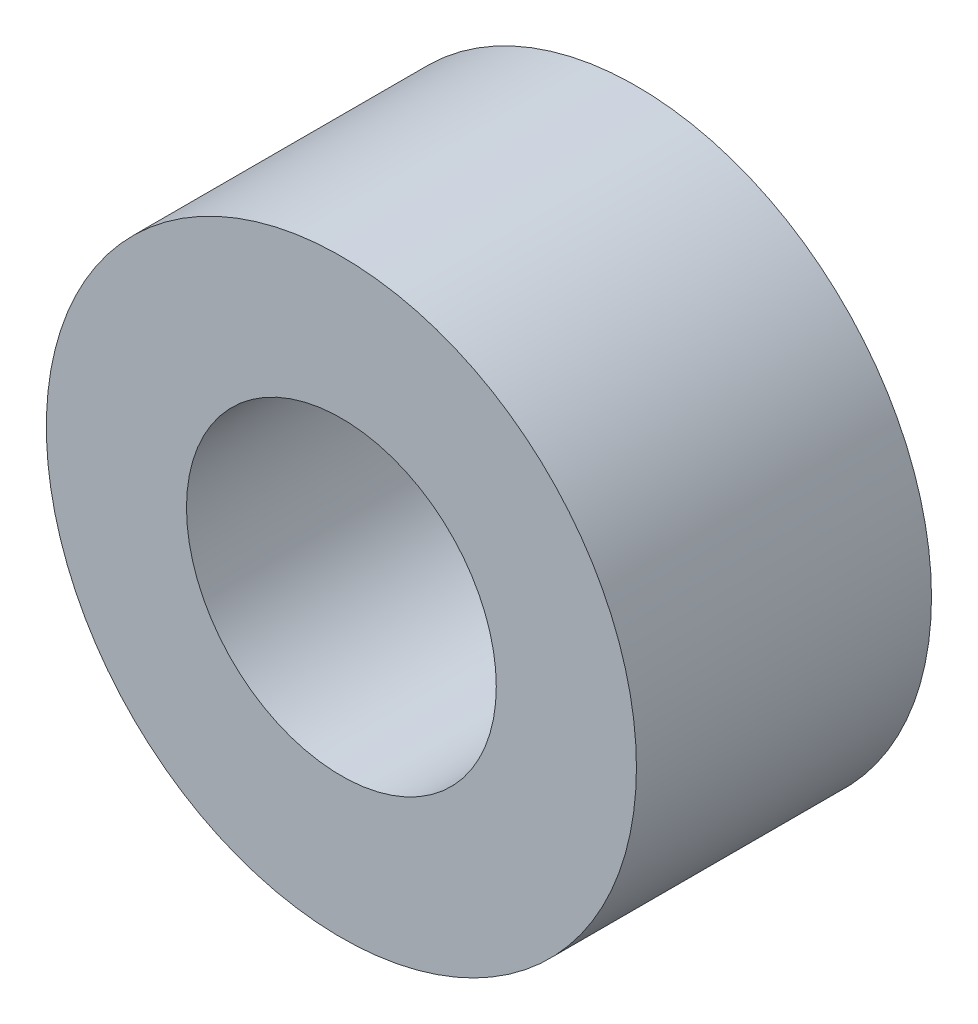
ISO-10303-21;
HEADER;
FILE_DESCRIPTION(('STEP AP214'),'2;1');
FILE_NAME('part.step','',(''),(''),'','','');
FILE_SCHEMA(('AUTOMOTIVE_DESIGN { 1 0 10303 214 1 1 1 1 }'));
ENDSEC;
DATA;
#1=APPLICATION_CONTEXT('core data for automotive mechanical design processes');
#2=APPLICATION_PROTOCOL_DEFINITION('international standard','automotive_design',2000,#1);
#3=PRODUCT_CONTEXT('',#1,'mechanical');
#4=PRODUCT('Part','Part','',(#3));
#5=PRODUCT_RELATED_PRODUCT_CATEGORY('part','',(#4));
#6=PRODUCT_DEFINITION_FORMATION('','',#4);
#7=PRODUCT_DEFINITION_CONTEXT('part definition',#1,'design');
#8=PRODUCT_DEFINITION('design','',#6,#7);
#9=PRODUCT_DEFINITION_SHAPE('','',#8);
#10=(LENGTH_UNIT() NAMED_UNIT(*) SI_UNIT(.MILLI.,.METRE.));
#11=(NAMED_UNIT(*) PLANE_ANGLE_UNIT() SI_UNIT($,.RADIAN.));
#12=(NAMED_UNIT(*) SI_UNIT($,.STERADIAN.) SOLID_ANGLE_UNIT());
#13=UNCERTAINTY_MEASURE_WITH_UNIT(LENGTH_MEASURE(1.E-05),#10,'distance_accuracy_value','');
#14=(GEOMETRIC_REPRESENTATION_CONTEXT(3) GLOBAL_UNCERTAINTY_ASSIGNED_CONTEXT((#13)) GLOBAL_UNIT_ASSIGNED_CONTEXT((#10,
#11,#12)) REPRESENTATION_CONTEXT('',''));
#15=CARTESIAN_POINT('',(0.,0.,0.));
#16=DIRECTION('',(0.,0.,1.));
#17=DIRECTION('',(1.,0.,0.));
#18=AXIS2_PLACEMENT_3D('',#15,#16,#17);
#19=CARTESIAN_POINT('',(0.,0.,2.));
#20=DIRECTION('',(0.,0.,1.));
#21=DIRECTION('',(1.,0.,0.));
#22=AXIS2_PLACEMENT_3D('',#19,#20,#21);
#23=PLANE('',#22);
#24=CARTESIAN_POINT('',(0.,0.,2.));
#25=DIRECTION('',(0.,0.,1.));
#26=DIRECTION('',(1.,0.,0.));
#27=AXIS2_PLACEMENT_3D('',#24,#25,#26);
#28=CIRCLE('',#27,4.);
#29=CARTESIAN_POINT('',(4.,0.,2.));
#30=VERTEX_POINT('',#29);
#31=EDGE_CURVE('E10',#30,#30,#28,.T.);
#32=ORIENTED_EDGE('',*,*,#31,.T.);
#33=EDGE_LOOP('',(#32));
#34=FACE_BOUND('',#33,.T.);
#35=CARTESIAN_POINT('',(0.,0.,2.));
#36=DIRECTION('',(0.,0.,1.));
#37=DIRECTION('',(1.,0.,0.));
#38=AXIS2_PLACEMENT_3D('',#35,#36,#37);
#39=CIRCLE('',#38,2.1);
#40=CARTESIAN_POINT('',(2.1,0.,2.));
#41=VERTEX_POINT('',#40);
#42=EDGE_CURVE('E38',#41,#41,#39,.T.);
#43=ORIENTED_EDGE('',*,*,#42,.F.);
#44=EDGE_LOOP('',(#43));
#45=FACE_BOUND('',#44,.T.);
#46=ADVANCED_FACE('F31',(#34,#45),#23,.T.);
#47=CARTESIAN_POINT('',(0.,0.,2.));
#48=DIRECTION('',(0.,0.,-1.));
#49=DIRECTION('',(-1.,0.,0.));
#50=AXIS2_PLACEMENT_3D('',#47,#48,#49);
#51=CYLINDRICAL_SURFACE('',#50,4.);
#52=ORIENTED_EDGE('',*,*,#31,.F.);
#53=EDGE_LOOP('',(#52));
#54=FACE_BOUND('',#53,.T.);
#55=CARTESIAN_POINT('',(0.,0.,-2.));
#56=DIRECTION('',(0.,0.,1.));
#57=DIRECTION('',(1.,0.,0.));
#58=AXIS2_PLACEMENT_3D('',#55,#56,#57);
#59=CIRCLE('',#58,4.);
#60=CARTESIAN_POINT('',(4.,0.,-2.));
#61=VERTEX_POINT('',#60);
#62=EDGE_CURVE('E42',#61,#61,#59,.T.);
#63=ORIENTED_EDGE('',*,*,#62,.T.);
#64=EDGE_LOOP('',(#63));
#65=FACE_BOUND('',#64,.T.);
#66=ADVANCED_FACE('F33',(#54,#65),#51,.T.);
#67=CARTESIAN_POINT('',(0.,0.,2.));
#68=DIRECTION('',(0.,0.,-1.));
#69=DIRECTION('',(-1.,0.,0.));
#70=AXIS2_PLACEMENT_3D('',#67,#68,#69);
#71=CYLINDRICAL_SURFACE('',#70,2.1);
#72=ORIENTED_EDGE('',*,*,#42,.T.);
#73=EDGE_LOOP('',(#72));
#74=FACE_BOUND('',#73,.T.);
#75=CARTESIAN_POINT('',(0.,0.,-2.));
#76=DIRECTION('',(0.,0.,1.));
#77=DIRECTION('',(1.,0.,0.));
#78=AXIS2_PLACEMENT_3D('',#75,#76,#77);
#79=CIRCLE('',#78,2.1);
#80=CARTESIAN_POINT('',(2.1,0.,-2.));
#81=VERTEX_POINT('',#80);
#82=EDGE_CURVE('E46',#81,#81,#79,.T.);
#83=ORIENTED_EDGE('',*,*,#82,.F.);
#84=EDGE_LOOP('',(#83));
#85=FACE_BOUND('',#84,.T.);
#86=ADVANCED_FACE('F55',(#74,#85),#71,.F.);
#87=CARTESIAN_POINT('',(0.,0.,-2.));
#88=DIRECTION('',(0.,0.,1.));
#89=DIRECTION('',(1.,0.,0.));
#90=AXIS2_PLACEMENT_3D('',#87,#88,#89);
#91=PLANE('',#90);
#92=ORIENTED_EDGE('',*,*,#82,.T.);
#93=EDGE_LOOP('',(#92));
#94=FACE_BOUND('',#93,.T.);
#95=ORIENTED_EDGE('',*,*,#62,.F.);
#96=EDGE_LOOP('',(#95));
#97=FACE_BOUND('',#96,.T.);
#98=ADVANCED_FACE('F52',(#94,#97),#91,.F.);
#99=CLOSED_SHELL('',(#46,#66,#86,#98));
#100=MANIFOLD_SOLID_BREP('B2',#99);
#101=ADVANCED_BREP_SHAPE_REPRESENTATION('',(#18,#100),#14);
#102=SHAPE_DEFINITION_REPRESENTATION(#9,#101);
ENDSEC;
END-ISO-10303-21;
